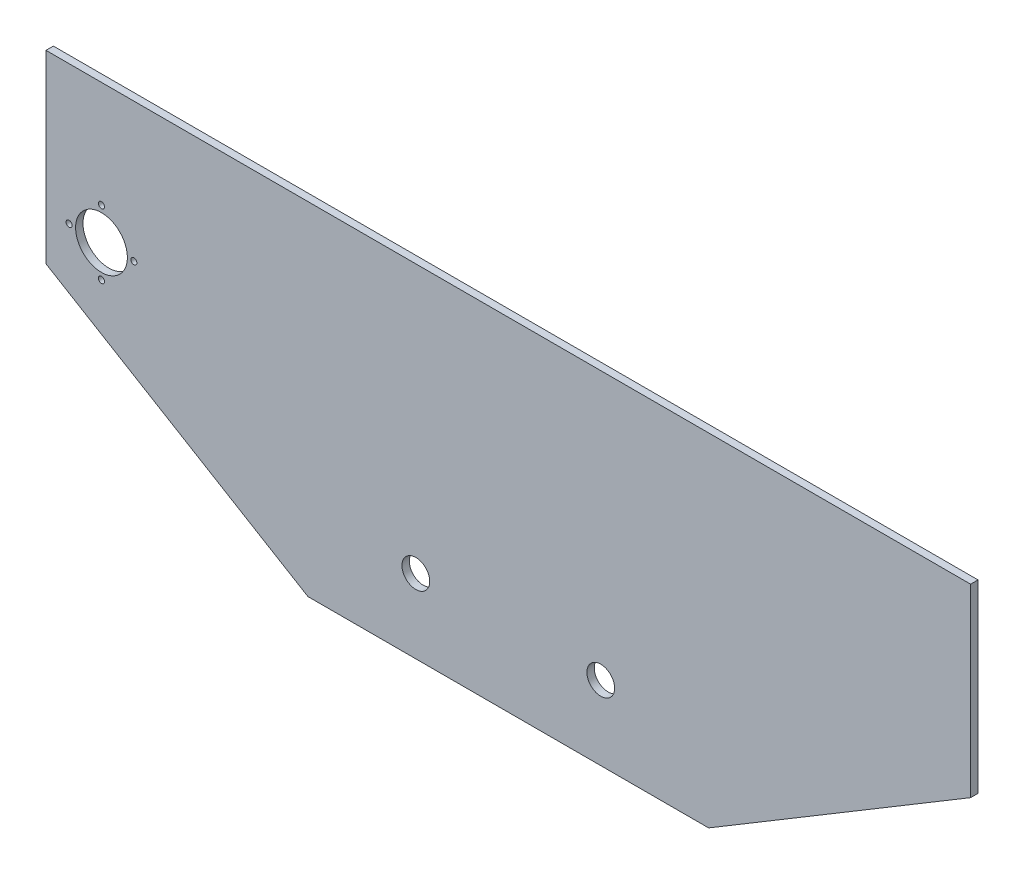
ISO-10303-21;
HEADER;
FILE_DESCRIPTION(('STEP AP214'),'2;1');
FILE_NAME('part.step','',(''),(''),'','','');
FILE_SCHEMA(('AUTOMOTIVE_DESIGN { 1 0 10303 214 1 1 1 1 }'));
ENDSEC;
DATA;
#1=APPLICATION_CONTEXT('core data for automotive mechanical design processes');
#2=APPLICATION_PROTOCOL_DEFINITION('international standard','automotive_design',2000,#1);
#3=PRODUCT_CONTEXT('',#1,'mechanical');
#4=PRODUCT('Part','Part','',(#3));
#5=PRODUCT_RELATED_PRODUCT_CATEGORY('part','',(#4));
#6=PRODUCT_DEFINITION_FORMATION('','',#4);
#7=PRODUCT_DEFINITION_CONTEXT('part definition',#1,'design');
#8=PRODUCT_DEFINITION('design','',#6,#7);
#9=PRODUCT_DEFINITION_SHAPE('','',#8);
#10=(LENGTH_UNIT() NAMED_UNIT(*) SI_UNIT(.MILLI.,.METRE.));
#11=(NAMED_UNIT(*) PLANE_ANGLE_UNIT() SI_UNIT($,.RADIAN.));
#12=(NAMED_UNIT(*) SI_UNIT($,.STERADIAN.) SOLID_ANGLE_UNIT());
#13=UNCERTAINTY_MEASURE_WITH_UNIT(LENGTH_MEASURE(1.E-05),#10,'distance_accuracy_value','');
#14=(GEOMETRIC_REPRESENTATION_CONTEXT(3) GLOBAL_UNCERTAINTY_ASSIGNED_CONTEXT((#13)) GLOBAL_UNIT_ASSIGNED_CONTEXT((#10,
#11,#12)) REPRESENTATION_CONTEXT('',''));
#15=CARTESIAN_POINT('',(0.,0.,0.));
#16=DIRECTION('',(0.,0.,1.));
#17=DIRECTION('',(1.,0.,0.));
#18=AXIS2_PLACEMENT_3D('',#15,#16,#17);
#19=CARTESIAN_POINT('',(0.,0.,-4.));
#20=DIRECTION('',(0.,0.,-1.));
#21=DIRECTION('',(-1.,0.,0.));
#22=AXIS2_PLACEMENT_3D('',#19,#20,#21);
#23=PLANE('',#22);
#24=CARTESIAN_POINT('',(-220.,87.5,-4.));
#25=DIRECTION('',(0.,0.,-1.));
#26=DIRECTION('',(-1.,0.,0.));
#27=AXIS2_PLACEMENT_3D('',#24,#25,#26);
#28=CIRCLE('',#27,1.65000000000002);
#29=CARTESIAN_POINT('',(-221.65,87.5,-4.));
#30=VERTEX_POINT('',#29);
#31=EDGE_CURVE('E150',#30,#30,#28,.T.);
#32=ORIENTED_EDGE('',*,*,#31,.F.);
#33=EDGE_LOOP('',(#32));
#34=FACE_BOUND('',#33,.T.);
#35=CARTESIAN_POINT('',(-237.5,69.9999999999999,-4.));
#36=DIRECTION('',(0.,0.,-1.));
#37=DIRECTION('',(-1.,0.,0.));
#38=AXIS2_PLACEMENT_3D('',#35,#36,#37);
#39=CIRCLE('',#38,1.65000000000001);
#40=CARTESIAN_POINT('',(-239.15,69.9999999999999,-4.));
#41=VERTEX_POINT('',#40);
#42=EDGE_CURVE('E244',#41,#41,#39,.T.);
#43=ORIENTED_EDGE('',*,*,#42,.F.);
#44=EDGE_LOOP('',(#43));
#45=FACE_BOUND('',#44,.T.);
#46=CARTESIAN_POINT('',(-220.,52.5,-4.));
#47=DIRECTION('',(0.,0.,-1.));
#48=DIRECTION('',(-1.,0.,0.));
#49=AXIS2_PLACEMENT_3D('',#46,#47,#48);
#50=CIRCLE('',#49,1.65000000000002);
#51=CARTESIAN_POINT('',(-221.65,52.5,-4.));
#52=VERTEX_POINT('',#51);
#53=EDGE_CURVE('E247',#52,#52,#50,.T.);
#54=ORIENTED_EDGE('',*,*,#53,.F.);
#55=EDGE_LOOP('',(#54));
#56=FACE_BOUND('',#55,.T.);
#57=CARTESIAN_POINT('',(-202.5,70.0000000000002,-4.));
#58=DIRECTION('',(0.,0.,-1.));
#59=DIRECTION('',(-1.,0.,0.));
#60=AXIS2_PLACEMENT_3D('',#57,#58,#59);
#61=CIRCLE('',#60,1.65000000000002);
#62=CARTESIAN_POINT('',(-204.15,70.0000000000002,-4.));
#63=VERTEX_POINT('',#62);
#64=EDGE_CURVE('E164',#63,#63,#61,.T.);
#65=ORIENTED_EDGE('',*,*,#64,.F.);
#66=EDGE_LOOP('',(#65));
#67=FACE_BOUND('',#66,.T.);
#68=CARTESIAN_POINT('',(-220.,70.,-4.));
#69=DIRECTION('',(0.,0.,-1.));
#70=DIRECTION('',(-1.,0.,0.));
#71=AXIS2_PLACEMENT_3D('',#68,#69,#70);
#72=CIRCLE('',#71,14.);
#73=CARTESIAN_POINT('',(-234.,70.,-4.));
#74=VERTEX_POINT('',#73);
#75=EDGE_CURVE('E145',#74,#74,#72,.T.);
#76=ORIENTED_EDGE('',*,*,#75,.F.);
#77=EDGE_LOOP('',(#76));
#78=FACE_BOUND('',#77,.T.);
#79=CARTESIAN_POINT('',(-50.,0.,-4.));
#80=DIRECTION('',(0.,0.,-1.));
#81=DIRECTION('',(-1.,0.,0.));
#82=AXIS2_PLACEMENT_3D('',#79,#80,#81);
#83=CIRCLE('',#82,7.5);
#84=CARTESIAN_POINT('',(-57.5,0.,-4.));
#85=VERTEX_POINT('',#84);
#86=EDGE_CURVE('E133',#85,#85,#83,.T.);
#87=ORIENTED_EDGE('',*,*,#86,.F.);
#88=EDGE_LOOP('',(#87));
#89=FACE_BOUND('',#88,.T.);
#90=CARTESIAN_POINT('',(50.,0.,-4.));
#91=DIRECTION('',(0.,0.,-1.));
#92=DIRECTION('',(-1.,0.,0.));
#93=AXIS2_PLACEMENT_3D('',#90,#91,#92);
#94=CIRCLE('',#93,7.50000000000001);
#95=CARTESIAN_POINT('',(42.5,0.,-4.));
#96=VERTEX_POINT('',#95);
#97=EDGE_CURVE('E126',#96,#96,#94,.T.);
#98=ORIENTED_EDGE('',*,*,#97,.F.);
#99=EDGE_LOOP('',(#98));
#100=FACE_BOUND('',#99,.T.);
#101=DIRECTION('',(0.857492925712544,0.514495755427527,0.));
#102=VECTOR('',#101,1.);
#103=CARTESIAN_POINT('',(46.3235294117646,-77.2058823529411,-4.));
#104=LINE('',#103,#102);
#105=CARTESIAN_POINT('',(108.333333333333,-40.,-4.));
#106=VERTEX_POINT('',#105);
#107=CARTESIAN_POINT('',(250.,45.,-4.));
#108=VERTEX_POINT('',#107);
#109=EDGE_CURVE('E108',#106,#108,#104,.T.);
#110=ORIENTED_EDGE('',*,*,#109,.F.);
#111=DIRECTION('',(-1.,0.,0.));
#112=VECTOR('',#111,1.);
#113=CARTESIAN_POINT('',(0.,-40.,-4.));
#114=LINE('',#113,#112);
#115=CARTESIAN_POINT('',(-108.333333333333,-40.,-4.));
#116=VERTEX_POINT('',#115);
#117=EDGE_CURVE('E58',#116,#106,#114,.F.);
#118=ORIENTED_EDGE('',*,*,#117,.F.);
#119=DIRECTION('',(0.857492925712544,-0.514495755427526,0.));
#120=VECTOR('',#119,1.);
#121=CARTESIAN_POINT('',(-46.3235294117646,-77.2058823529411,-4.));
#122=LINE('',#121,#120);
#123=CARTESIAN_POINT('',(-250.,44.9999999999999,-4.));
#124=VERTEX_POINT('',#123);
#125=EDGE_CURVE('E106',#124,#116,#122,.T.);
#126=ORIENTED_EDGE('',*,*,#125,.F.);
#127=DIRECTION('',(0.,-1.,0.));
#128=VECTOR('',#127,1.);
#129=CARTESIAN_POINT('',(-250.,-75.,-4.));
#130=LINE('',#129,#128);
#131=CARTESIAN_POINT('',(-250.,145.,-4.));
#132=VERTEX_POINT('',#131);
#133=EDGE_CURVE('E11',#132,#124,#130,.T.);
#134=ORIENTED_EDGE('',*,*,#133,.F.);
#135=DIRECTION('',(1.,0.,0.));
#136=VECTOR('',#135,1.);
#137=CARTESIAN_POINT('',(250.,145.,-4.));
#138=LINE('',#137,#136);
#139=CARTESIAN_POINT('',(250.,145.,-4.));
#140=VERTEX_POINT('',#139);
#141=EDGE_CURVE('E168',#132,#140,#138,.T.);
#142=ORIENTED_EDGE('',*,*,#141,.T.);
#143=DIRECTION('',(0.,1.,0.));
#144=VECTOR('',#143,1.);
#145=CARTESIAN_POINT('',(250.,-75.,-4.));
#146=LINE('',#145,#144);
#147=EDGE_CURVE('E50',#108,#140,#146,.T.);
#148=ORIENTED_EDGE('',*,*,#147,.F.);
#149=EDGE_LOOP('',(#110,#118,#126,#134,#142,#148));
#150=FACE_BOUND('',#149,.T.);
#151=ADVANCED_FACE('F41',(#34,#45,#56,#67,#78,#89,#100,#150),#23,.T.);
#152=CARTESIAN_POINT('',(0.,0.,0.));
#153=DIRECTION('',(0.,0.,-1.));
#154=DIRECTION('',(-1.,0.,0.));
#155=AXIS2_PLACEMENT_3D('',#152,#153,#154);
#156=PLANE('',#155);
#157=CARTESIAN_POINT('',(-220.,87.5,0.));
#158=DIRECTION('',(0.,0.,-1.));
#159=DIRECTION('',(-1.,0.,0.));
#160=AXIS2_PLACEMENT_3D('',#157,#158,#159);
#161=CIRCLE('',#160,1.65000000000002);
#162=CARTESIAN_POINT('',(-221.65,87.5,0.));
#163=VERTEX_POINT('',#162);
#164=EDGE_CURVE('E45',#163,#163,#161,.T.);
#165=ORIENTED_EDGE('',*,*,#164,.T.);
#166=EDGE_LOOP('',(#165));
#167=FACE_BOUND('',#166,.T.);
#168=CARTESIAN_POINT('',(-237.5,69.9999999999999,0.));
#169=DIRECTION('',(0.,0.,-1.));
#170=DIRECTION('',(-1.,0.,0.));
#171=AXIS2_PLACEMENT_3D('',#168,#169,#170);
#172=CIRCLE('',#171,1.65000000000001);
#173=CARTESIAN_POINT('',(-239.15,69.9999999999999,0.));
#174=VERTEX_POINT('',#173);
#175=EDGE_CURVE('E152',#174,#174,#172,.T.);
#176=ORIENTED_EDGE('',*,*,#175,.T.);
#177=EDGE_LOOP('',(#176));
#178=FACE_BOUND('',#177,.T.);
#179=CARTESIAN_POINT('',(-220.,52.5,0.));
#180=DIRECTION('',(0.,0.,-1.));
#181=DIRECTION('',(-1.,0.,0.));
#182=AXIS2_PLACEMENT_3D('',#179,#180,#181);
#183=CIRCLE('',#182,1.65000000000002);
#184=CARTESIAN_POINT('',(-221.65,52.5,0.));
#185=VERTEX_POINT('',#184);
#186=EDGE_CURVE('E149',#185,#185,#183,.T.);
#187=ORIENTED_EDGE('',*,*,#186,.T.);
#188=EDGE_LOOP('',(#187));
#189=FACE_BOUND('',#188,.T.);
#190=CARTESIAN_POINT('',(-202.5,70.0000000000002,0.));
#191=DIRECTION('',(0.,0.,-1.));
#192=DIRECTION('',(-1.,0.,0.));
#193=AXIS2_PLACEMENT_3D('',#190,#191,#192);
#194=CIRCLE('',#193,1.65000000000002);
#195=CARTESIAN_POINT('',(-204.15,70.0000000000002,0.));
#196=VERTEX_POINT('',#195);
#197=EDGE_CURVE('E146',#196,#196,#194,.T.);
#198=ORIENTED_EDGE('',*,*,#197,.T.);
#199=EDGE_LOOP('',(#198));
#200=FACE_BOUND('',#199,.T.);
#201=CARTESIAN_POINT('',(-220.,70.,0.));
#202=DIRECTION('',(0.,0.,-1.));
#203=DIRECTION('',(-1.,0.,0.));
#204=AXIS2_PLACEMENT_3D('',#201,#202,#203);
#205=CIRCLE('',#204,14.);
#206=CARTESIAN_POINT('',(-234.,70.,0.));
#207=VERTEX_POINT('',#206);
#208=EDGE_CURVE('E142',#207,#207,#205,.T.);
#209=ORIENTED_EDGE('',*,*,#208,.T.);
#210=EDGE_LOOP('',(#209));
#211=FACE_BOUND('',#210,.T.);
#212=CARTESIAN_POINT('',(50.,0.,0.));
#213=DIRECTION('',(0.,0.,1.));
#214=DIRECTION('',(1.,0.,0.));
#215=AXIS2_PLACEMENT_3D('',#212,#213,#214);
#216=CIRCLE('',#215,7.50000000000001);
#217=CARTESIAN_POINT('',(57.5,0.,0.));
#218=VERTEX_POINT('',#217);
#219=EDGE_CURVE('E127',#218,#218,#216,.T.);
#220=ORIENTED_EDGE('',*,*,#219,.F.);
#221=EDGE_LOOP('',(#220));
#222=FACE_BOUND('',#221,.T.);
#223=CARTESIAN_POINT('',(-50.,0.,0.));
#224=DIRECTION('',(0.,0.,1.));
#225=DIRECTION('',(1.,0.,0.));
#226=AXIS2_PLACEMENT_3D('',#223,#224,#225);
#227=CIRCLE('',#226,7.5);
#228=CARTESIAN_POINT('',(-42.5,0.,0.));
#229=VERTEX_POINT('',#228);
#230=EDGE_CURVE('E123',#229,#229,#227,.T.);
#231=ORIENTED_EDGE('',*,*,#230,.F.);
#232=EDGE_LOOP('',(#231));
#233=FACE_BOUND('',#232,.T.);
#234=DIRECTION('',(1.,0.,0.));
#235=VECTOR('',#234,1.);
#236=CARTESIAN_POINT('',(0.,-40.,0.));
#237=LINE('',#236,#235);
#238=CARTESIAN_POINT('',(-108.333333333333,-40.,0.));
#239=VERTEX_POINT('',#238);
#240=CARTESIAN_POINT('',(108.333333333333,-40.,0.));
#241=VERTEX_POINT('',#240);
#242=EDGE_CURVE('E97',#239,#241,#237,.T.);
#243=ORIENTED_EDGE('',*,*,#242,.T.);
#244=DIRECTION('',(0.857492925712544,0.514495755427527,0.));
#245=VECTOR('',#244,1.);
#246=CARTESIAN_POINT('',(46.3235294117646,-77.2058823529411,0.));
#247=LINE('',#246,#245);
#248=CARTESIAN_POINT('',(250.,45.,0.));
#249=VERTEX_POINT('',#248);
#250=EDGE_CURVE('E66',#241,#249,#247,.T.);
#251=ORIENTED_EDGE('',*,*,#250,.T.);
#252=DIRECTION('',(0.,1.,0.));
#253=VECTOR('',#252,1.);
#254=CARTESIAN_POINT('',(250.,-75.,0.));
#255=LINE('',#254,#253);
#256=CARTESIAN_POINT('',(250.,145.,0.));
#257=VERTEX_POINT('',#256);
#258=EDGE_CURVE('E136',#249,#257,#255,.T.);
#259=ORIENTED_EDGE('',*,*,#258,.T.);
#260=DIRECTION('',(1.,0.,0.));
#261=VECTOR('',#260,1.);
#262=CARTESIAN_POINT('',(250.,145.,0.));
#263=LINE('',#262,#261);
#264=CARTESIAN_POINT('',(-250.,145.,0.));
#265=VERTEX_POINT('',#264);
#266=EDGE_CURVE('E170',#265,#257,#263,.T.);
#267=ORIENTED_EDGE('',*,*,#266,.F.);
#268=DIRECTION('',(0.,-1.,0.));
#269=VECTOR('',#268,1.);
#270=CARTESIAN_POINT('',(-250.,-75.,0.));
#271=LINE('',#270,#269);
#272=CARTESIAN_POINT('',(-250.,44.9999999999999,0.));
#273=VERTEX_POINT('',#272);
#274=EDGE_CURVE('E137',#265,#273,#271,.T.);
#275=ORIENTED_EDGE('',*,*,#274,.T.);
#276=DIRECTION('',(0.857492925712544,-0.514495755427526,0.));
#277=VECTOR('',#276,1.);
#278=CARTESIAN_POINT('',(-46.3235294117646,-77.2058823529411,0.));
#279=LINE('',#278,#277);
#280=EDGE_CURVE('E113',#273,#239,#279,.T.);
#281=ORIENTED_EDGE('',*,*,#280,.T.);
#282=EDGE_LOOP('',(#243,#251,#259,#267,#275,#281));
#283=FACE_BOUND('',#282,.T.);
#284=ADVANCED_FACE('F185',(#167,#178,#189,#200,#211,#222,#233,#283),#156,.F.);
#285=CARTESIAN_POINT('',(-46.3235294117646,-77.2058823529411,-4.));
#286=DIRECTION('',(0.514495755427526,0.857492925712544,0.));
#287=DIRECTION('',(0.857492925712544,-0.514495755427526,0.));
#288=AXIS2_PLACEMENT_3D('',#285,#286,#287);
#289=PLANE('',#288);
#290=ORIENTED_EDGE('',*,*,#125,.T.);
#291=DIRECTION('',(0.,0.,1.));
#292=VECTOR('',#291,1.);
#293=CARTESIAN_POINT('',(-108.333333333333,-40.,0.));
#294=LINE('',#293,#292);
#295=EDGE_CURVE('E95',#239,#116,#294,.F.);
#296=ORIENTED_EDGE('',*,*,#295,.F.);
#297=ORIENTED_EDGE('',*,*,#280,.F.);
#298=DIRECTION('',(0.,0.,-1.));
#299=VECTOR('',#298,1.);
#300=CARTESIAN_POINT('',(-250.,44.9999999999999,-4.));
#301=LINE('',#300,#299);
#302=EDGE_CURVE('E112',#124,#273,#301,.F.);
#303=ORIENTED_EDGE('',*,*,#302,.F.);
#304=EDGE_LOOP('',(#290,#296,#297,#303));
#305=FACE_BOUND('',#304,.T.);
#306=ADVANCED_FACE('F110',(#305),#289,.F.);
#307=CARTESIAN_POINT('',(46.3235294117646,-77.2058823529411,-4.));
#308=DIRECTION('',(-0.514495755427526,0.857492925712544,0.));
#309=DIRECTION('',(0.857492925712544,0.514495755427527,0.));
#310=AXIS2_PLACEMENT_3D('',#307,#308,#309);
#311=PLANE('',#310);
#312=ORIENTED_EDGE('',*,*,#250,.F.);
#313=DIRECTION('',(0.,0.,1.));
#314=VECTOR('',#313,1.);
#315=CARTESIAN_POINT('',(108.333333333333,-40.,0.));
#316=LINE('',#315,#314);
#317=EDGE_CURVE('E101',#241,#106,#316,.F.);
#318=ORIENTED_EDGE('',*,*,#317,.T.);
#319=ORIENTED_EDGE('',*,*,#109,.T.);
#320=DIRECTION('',(0.,0.,-1.));
#321=VECTOR('',#320,1.);
#322=CARTESIAN_POINT('',(250.,45.,-4.));
#323=LINE('',#322,#321);
#324=EDGE_CURVE('E130',#108,#249,#323,.F.);
#325=ORIENTED_EDGE('',*,*,#324,.T.);
#326=EDGE_LOOP('',(#312,#318,#319,#325));
#327=FACE_BOUND('',#326,.T.);
#328=ADVANCED_FACE('F181',(#327),#311,.F.);
#329=CARTESIAN_POINT('',(250.,-75.,-4.));
#330=DIRECTION('',(1.,0.,0.));
#331=DIRECTION('',(0.,0.,-1.));
#332=AXIS2_PLACEMENT_3D('',#329,#330,#331);
#333=PLANE('',#332);
#334=ORIENTED_EDGE('',*,*,#258,.F.);
#335=ORIENTED_EDGE('',*,*,#324,.F.);
#336=ORIENTED_EDGE('',*,*,#147,.T.);
#337=DIRECTION('',(0.,0.,-1.));
#338=VECTOR('',#337,1.);
#339=CARTESIAN_POINT('',(250.,145.,0.));
#340=LINE('',#339,#338);
#341=EDGE_CURVE('E114',#257,#140,#340,.T.);
#342=ORIENTED_EDGE('',*,*,#341,.F.);
#343=EDGE_LOOP('',(#334,#335,#336,#342));
#344=FACE_BOUND('',#343,.T.);
#345=ADVANCED_FACE('F43',(#344),#333,.T.);
#346=CARTESIAN_POINT('',(-250.,-75.,-4.));
#347=DIRECTION('',(-1.,0.,0.));
#348=DIRECTION('',(0.,0.,1.));
#349=AXIS2_PLACEMENT_3D('',#346,#347,#348);
#350=PLANE('',#349);
#351=ORIENTED_EDGE('',*,*,#133,.T.);
#352=ORIENTED_EDGE('',*,*,#302,.T.);
#353=ORIENTED_EDGE('',*,*,#274,.F.);
#354=DIRECTION('',(0.,0.,-1.));
#355=VECTOR('',#354,1.);
#356=CARTESIAN_POINT('',(-250.,145.,0.));
#357=LINE('',#356,#355);
#358=EDGE_CURVE('E118',#265,#132,#357,.T.);
#359=ORIENTED_EDGE('',*,*,#358,.T.);
#360=EDGE_LOOP('',(#351,#352,#353,#359));
#361=FACE_BOUND('',#360,.T.);
#362=ADVANCED_FACE('F191',(#361),#350,.T.);
#363=CARTESIAN_POINT('',(50.,0.,-10.));
#364=DIRECTION('',(0.,0.,1.));
#365=DIRECTION('',(1.,0.,0.));
#366=AXIS2_PLACEMENT_3D('',#363,#364,#365);
#367=CYLINDRICAL_SURFACE('',#366,7.50000000000001);
#368=ORIENTED_EDGE('',*,*,#97,.T.);
#369=EDGE_LOOP('',(#368));
#370=FACE_BOUND('',#369,.T.);
#371=ORIENTED_EDGE('',*,*,#219,.T.);
#372=EDGE_LOOP('',(#371));
#373=FACE_BOUND('',#372,.T.);
#374=ADVANCED_FACE('F193',(#370,#373),#367,.F.);
#375=CARTESIAN_POINT('',(-50.,0.,-10.));
#376=DIRECTION('',(0.,0.,1.));
#377=DIRECTION('',(1.,0.,0.));
#378=AXIS2_PLACEMENT_3D('',#375,#376,#377);
#379=CYLINDRICAL_SURFACE('',#378,7.5);
#380=ORIENTED_EDGE('',*,*,#86,.T.);
#381=EDGE_LOOP('',(#380));
#382=FACE_BOUND('',#381,.T.);
#383=ORIENTED_EDGE('',*,*,#230,.T.);
#384=EDGE_LOOP('',(#383));
#385=FACE_BOUND('',#384,.T.);
#386=ADVANCED_FACE('F198',(#382,#385),#379,.F.);
#387=CARTESIAN_POINT('',(250.,145.,0.));
#388=DIRECTION('',(0.,1.,0.));
#389=DIRECTION('',(0.,0.,1.));
#390=AXIS2_PLACEMENT_3D('',#387,#388,#389);
#391=PLANE('',#390);
#392=ORIENTED_EDGE('',*,*,#141,.F.);
#393=ORIENTED_EDGE('',*,*,#358,.F.);
#394=ORIENTED_EDGE('',*,*,#266,.T.);
#395=ORIENTED_EDGE('',*,*,#341,.T.);
#396=EDGE_LOOP('',(#392,#393,#394,#395));
#397=FACE_BOUND('',#396,.T.);
#398=ADVANCED_FACE('F189',(#397),#391,.T.);
#399=CARTESIAN_POINT('',(0.,-40.,0.));
#400=DIRECTION('',(0.,1.,0.));
#401=DIRECTION('',(1.,0.,0.));
#402=AXIS2_PLACEMENT_3D('',#399,#400,#401);
#403=PLANE('',#402);
#404=ORIENTED_EDGE('',*,*,#317,.F.);
#405=ORIENTED_EDGE('',*,*,#242,.F.);
#406=ORIENTED_EDGE('',*,*,#295,.T.);
#407=ORIENTED_EDGE('',*,*,#117,.T.);
#408=EDGE_LOOP('',(#404,#405,#406,#407));
#409=FACE_BOUND('',#408,.T.);
#410=ADVANCED_FACE('F96',(#409),#403,.F.);
#411=CARTESIAN_POINT('',(-220.,70.,6.));
#412=DIRECTION('',(0.,0.,-1.));
#413=DIRECTION('',(-1.,0.,0.));
#414=AXIS2_PLACEMENT_3D('',#411,#412,#413);
#415=CYLINDRICAL_SURFACE('',#414,14.);
#416=ORIENTED_EDGE('',*,*,#75,.T.);
#417=EDGE_LOOP('',(#416));
#418=FACE_BOUND('',#417,.T.);
#419=ORIENTED_EDGE('',*,*,#208,.F.);
#420=EDGE_LOOP('',(#419));
#421=FACE_BOUND('',#420,.T.);
#422=ADVANCED_FACE('F222',(#418,#421),#415,.F.);
#423=CARTESIAN_POINT('',(-202.5,70.0000000000002,6.));
#424=DIRECTION('',(0.,0.,-1.));
#425=DIRECTION('',(-1.,0.,0.));
#426=AXIS2_PLACEMENT_3D('',#423,#424,#425);
#427=CYLINDRICAL_SURFACE('',#426,1.65000000000002);
#428=ORIENTED_EDGE('',*,*,#64,.T.);
#429=EDGE_LOOP('',(#428));
#430=FACE_BOUND('',#429,.T.);
#431=ORIENTED_EDGE('',*,*,#197,.F.);
#432=EDGE_LOOP('',(#431));
#433=FACE_BOUND('',#432,.T.);
#434=ADVANCED_FACE('F225',(#430,#433),#427,.F.);
#435=CARTESIAN_POINT('',(-220.,52.5,6.));
#436=DIRECTION('',(0.,0.,-1.));
#437=DIRECTION('',(-1.,0.,0.));
#438=AXIS2_PLACEMENT_3D('',#435,#436,#437);
#439=CYLINDRICAL_SURFACE('',#438,1.65000000000002);
#440=ORIENTED_EDGE('',*,*,#53,.T.);
#441=EDGE_LOOP('',(#440));
#442=FACE_BOUND('',#441,.T.);
#443=ORIENTED_EDGE('',*,*,#186,.F.);
#444=EDGE_LOOP('',(#443));
#445=FACE_BOUND('',#444,.T.);
#446=ADVANCED_FACE('F228',(#442,#445),#439,.F.);
#447=CARTESIAN_POINT('',(-237.5,69.9999999999999,6.));
#448=DIRECTION('',(0.,0.,-1.));
#449=DIRECTION('',(-1.,0.,0.));
#450=AXIS2_PLACEMENT_3D('',#447,#448,#449);
#451=CYLINDRICAL_SURFACE('',#450,1.65000000000001);
#452=ORIENTED_EDGE('',*,*,#42,.T.);
#453=EDGE_LOOP('',(#452));
#454=FACE_BOUND('',#453,.T.);
#455=ORIENTED_EDGE('',*,*,#175,.F.);
#456=EDGE_LOOP('',(#455));
#457=FACE_BOUND('',#456,.T.);
#458=ADVANCED_FACE('F232',(#454,#457),#451,.F.);
#459=CARTESIAN_POINT('',(-220.,87.5,6.));
#460=DIRECTION('',(0.,0.,-1.));
#461=DIRECTION('',(-1.,0.,0.));
#462=AXIS2_PLACEMENT_3D('',#459,#460,#461);
#463=CYLINDRICAL_SURFACE('',#462,1.65000000000002);
#464=ORIENTED_EDGE('',*,*,#31,.T.);
#465=EDGE_LOOP('',(#464));
#466=FACE_BOUND('',#465,.T.);
#467=ORIENTED_EDGE('',*,*,#164,.F.);
#468=EDGE_LOOP('',(#467));
#469=FACE_BOUND('',#468,.T.);
#470=ADVANCED_FACE('F236',(#466,#469),#463,.F.);
#471=CLOSED_SHELL('',(#151,#284,#306,#328,#345,#362,#374,#386,#398,#410,#422,#434,#446,#458,#470));
#472=MANIFOLD_SOLID_BREP('B2',#471);
#473=ADVANCED_BREP_SHAPE_REPRESENTATION('',(#18,#472),#14);
#474=SHAPE_DEFINITION_REPRESENTATION(#9,#473);
ENDSEC;
END-ISO-10303-21;
